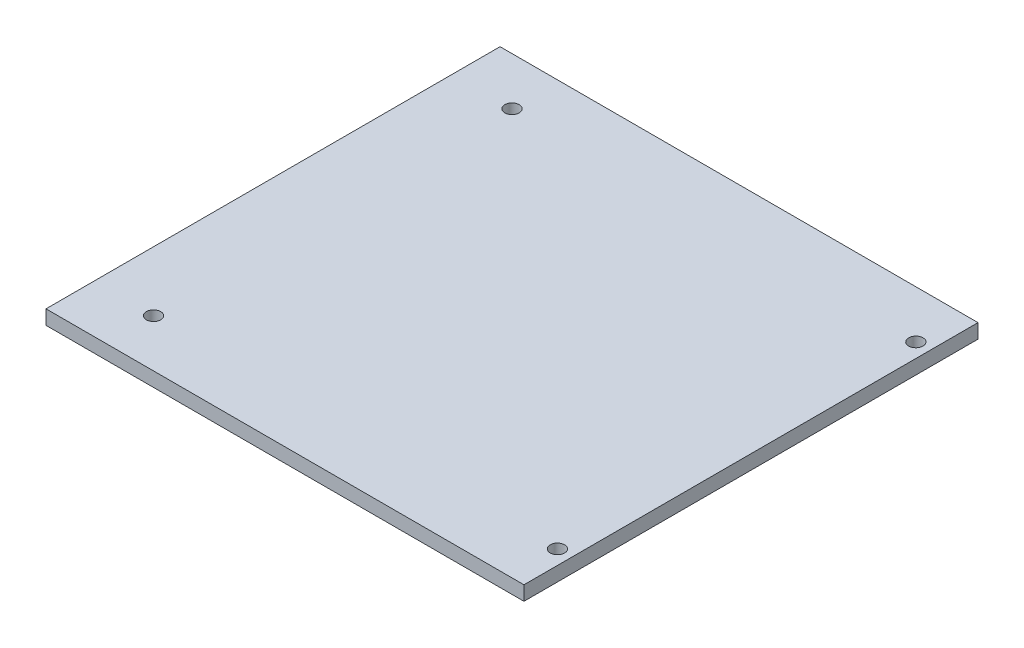
ISO-10303-21;
HEADER;
FILE_DESCRIPTION(('STEP AP214'),'2;1');
FILE_NAME('part.step','',(''),(''),'','','');
FILE_SCHEMA(('AUTOMOTIVE_DESIGN { 1 0 10303 214 1 1 1 1 }'));
ENDSEC;
DATA;
#1=APPLICATION_CONTEXT('core data for automotive mechanical design processes');
#2=APPLICATION_PROTOCOL_DEFINITION('international standard','automotive_design',2000,#1);
#3=PRODUCT_CONTEXT('',#1,'mechanical');
#4=PRODUCT('Part','Part','',(#3));
#5=PRODUCT_RELATED_PRODUCT_CATEGORY('part','',(#4));
#6=PRODUCT_DEFINITION_FORMATION('','',#4);
#7=PRODUCT_DEFINITION_CONTEXT('part definition',#1,'design');
#8=PRODUCT_DEFINITION('design','',#6,#7);
#9=PRODUCT_DEFINITION_SHAPE('','',#8);
#10=(LENGTH_UNIT() NAMED_UNIT(*) SI_UNIT(.MILLI.,.METRE.));
#11=(NAMED_UNIT(*) PLANE_ANGLE_UNIT() SI_UNIT($,.RADIAN.));
#12=(NAMED_UNIT(*) SI_UNIT($,.STERADIAN.) SOLID_ANGLE_UNIT());
#13=UNCERTAINTY_MEASURE_WITH_UNIT(LENGTH_MEASURE(1.E-05),#10,'distance_accuracy_value','');
#14=(GEOMETRIC_REPRESENTATION_CONTEXT(3) GLOBAL_UNCERTAINTY_ASSIGNED_CONTEXT((#13)) GLOBAL_UNIT_ASSIGNED_CONTEXT((#10,
#11,#12)) REPRESENTATION_CONTEXT('',''));
#15=CARTESIAN_POINT('',(0.,0.,0.));
#16=DIRECTION('',(0.,0.,1.));
#17=DIRECTION('',(1.,0.,0.));
#18=AXIS2_PLACEMENT_3D('',#15,#16,#17);
#19=CARTESIAN_POINT('',(0.,3.,0.));
#20=DIRECTION('',(0.,1.,0.));
#21=DIRECTION('',(0.,0.,1.));
#22=AXIS2_PLACEMENT_3D('',#19,#20,#21);
#23=PLANE('',#22);
#24=CARTESIAN_POINT('',(47.,3.,37.5));
#25=DIRECTION('',(0.,1.,0.));
#26=DIRECTION('',(0.,0.,1.));
#27=AXIS2_PLACEMENT_3D('',#24,#25,#26);
#28=CIRCLE('',#27,1.5);
#29=CARTESIAN_POINT('',(47.,3.,39.));
#30=VERTEX_POINT('',#29);
#31=EDGE_CURVE('E121',#30,#30,#28,.T.);
#32=ORIENTED_EDGE('',*,*,#31,.F.);
#33=EDGE_LOOP('',(#32));
#34=FACE_BOUND('',#33,.T.);
#35=CARTESIAN_POINT('',(-37.5,3.,-37.5));
#36=DIRECTION('',(0.,1.,0.));
#37=DIRECTION('',(0.,0.,1.));
#38=AXIS2_PLACEMENT_3D('',#35,#36,#37);
#39=CIRCLE('',#38,1.5);
#40=CARTESIAN_POINT('',(-37.5,3.,-36.));
#41=VERTEX_POINT('',#40);
#42=EDGE_CURVE('E100',#41,#41,#39,.T.);
#43=ORIENTED_EDGE('',*,*,#42,.F.);
#44=EDGE_LOOP('',(#43));
#45=FACE_BOUND('',#44,.T.);
#46=DIRECTION('',(0.,0.,1.));
#47=VECTOR('',#46,1.);
#48=CARTESIAN_POINT('',(-50.,3.,47.5));
#49=LINE('',#48,#47);
#50=CARTESIAN_POINT('',(-50.,3.,-47.5));
#51=VERTEX_POINT('',#50);
#52=CARTESIAN_POINT('',(-50.,3.,47.5));
#53=VERTEX_POINT('',#52);
#54=EDGE_CURVE('E85',#51,#53,#49,.T.);
#55=ORIENTED_EDGE('',*,*,#54,.T.);
#56=DIRECTION('',(1.,0.,0.));
#57=VECTOR('',#56,1.);
#58=CARTESIAN_POINT('',(50.,3.,47.5));
#59=LINE('',#58,#57);
#60=CARTESIAN_POINT('',(50.,3.,47.5));
#61=VERTEX_POINT('',#60);
#62=EDGE_CURVE('E80',#53,#61,#59,.T.);
#63=ORIENTED_EDGE('',*,*,#62,.T.);
#64=DIRECTION('',(0.,0.,-1.));
#65=VECTOR('',#64,1.);
#66=CARTESIAN_POINT('',(50.,3.,47.5));
#67=LINE('',#66,#65);
#68=CARTESIAN_POINT('',(50.,3.,-47.5));
#69=VERTEX_POINT('',#68);
#70=EDGE_CURVE('E83',#61,#69,#67,.T.);
#71=ORIENTED_EDGE('',*,*,#70,.T.);
#72=DIRECTION('',(-1.,0.,0.));
#73=VECTOR('',#72,1.);
#74=CARTESIAN_POINT('',(50.,3.,-47.5));
#75=LINE('',#74,#73);
#76=EDGE_CURVE('E50',#69,#51,#75,.T.);
#77=ORIENTED_EDGE('',*,*,#76,.T.);
#78=EDGE_LOOP('',(#55,#63,#71,#77));
#79=FACE_BOUND('',#78,.T.);
#80=CARTESIAN_POINT('',(47.,3.,-37.5));
#81=DIRECTION('',(0.,1.,0.));
#82=DIRECTION('',(0.,0.,1.));
#83=AXIS2_PLACEMENT_3D('',#80,#81,#82);
#84=CIRCLE('',#83,1.5);
#85=CARTESIAN_POINT('',(47.,3.,-36.));
#86=VERTEX_POINT('',#85);
#87=EDGE_CURVE('E115',#86,#86,#84,.T.);
#88=ORIENTED_EDGE('',*,*,#87,.F.);
#89=EDGE_LOOP('',(#88));
#90=FACE_BOUND('',#89,.T.);
#91=CARTESIAN_POINT('',(-37.5,3.,37.5));
#92=DIRECTION('',(0.,1.,0.));
#93=DIRECTION('',(0.,0.,1.));
#94=AXIS2_PLACEMENT_3D('',#91,#92,#93);
#95=CIRCLE('',#94,1.5);
#96=CARTESIAN_POINT('',(-37.5,3.,39.));
#97=VERTEX_POINT('',#96);
#98=EDGE_CURVE('E127',#97,#97,#95,.T.);
#99=ORIENTED_EDGE('',*,*,#98,.F.);
#100=EDGE_LOOP('',(#99));
#101=FACE_BOUND('',#100,.T.);
#102=ADVANCED_FACE('F33',(#34,#45,#79,#90,#101),#23,.T.);
#103=CARTESIAN_POINT('',(0.,0.,0.));
#104=DIRECTION('',(0.,1.,0.));
#105=DIRECTION('',(0.,0.,1.));
#106=AXIS2_PLACEMENT_3D('',#103,#104,#105);
#107=PLANE('',#106);
#108=CARTESIAN_POINT('',(47.,0.,37.5));
#109=DIRECTION('',(0.,1.,0.));
#110=DIRECTION('',(0.,0.,1.));
#111=AXIS2_PLACEMENT_3D('',#108,#109,#110);
#112=CIRCLE('',#111,1.5);
#113=CARTESIAN_POINT('',(47.,0.,39.));
#114=VERTEX_POINT('',#113);
#115=EDGE_CURVE('E124',#114,#114,#112,.T.);
#116=ORIENTED_EDGE('',*,*,#115,.T.);
#117=EDGE_LOOP('',(#116));
#118=FACE_BOUND('',#117,.T.);
#119=CARTESIAN_POINT('',(-37.5,0.,-37.5));
#120=DIRECTION('',(0.,1.,0.));
#121=DIRECTION('',(0.,0.,1.));
#122=AXIS2_PLACEMENT_3D('',#119,#120,#121);
#123=CIRCLE('',#122,1.5);
#124=CARTESIAN_POINT('',(-37.5,0.,-36.));
#125=VERTEX_POINT('',#124);
#126=EDGE_CURVE('E112',#125,#125,#123,.T.);
#127=ORIENTED_EDGE('',*,*,#126,.T.);
#128=EDGE_LOOP('',(#127));
#129=FACE_BOUND('',#128,.T.);
#130=DIRECTION('',(0.,0.,1.));
#131=VECTOR('',#130,1.);
#132=CARTESIAN_POINT('',(-50.,0.,47.5));
#133=LINE('',#132,#131);
#134=CARTESIAN_POINT('',(-50.,0.,-47.5));
#135=VERTEX_POINT('',#134);
#136=CARTESIAN_POINT('',(-50.,0.,47.5));
#137=VERTEX_POINT('',#136);
#138=EDGE_CURVE('E97',#135,#137,#133,.T.);
#139=ORIENTED_EDGE('',*,*,#138,.F.);
#140=DIRECTION('',(-1.,0.,0.));
#141=VECTOR('',#140,1.);
#142=CARTESIAN_POINT('',(50.,0.,-47.5));
#143=LINE('',#142,#141);
#144=CARTESIAN_POINT('',(50.,0.,-47.5));
#145=VERTEX_POINT('',#144);
#146=EDGE_CURVE('E73',#145,#135,#143,.T.);
#147=ORIENTED_EDGE('',*,*,#146,.F.);
#148=DIRECTION('',(0.,0.,-1.));
#149=VECTOR('',#148,1.);
#150=CARTESIAN_POINT('',(50.,0.,47.5));
#151=LINE('',#150,#149);
#152=CARTESIAN_POINT('',(50.,0.,47.5));
#153=VERTEX_POINT('',#152);
#154=EDGE_CURVE('E67',#153,#145,#151,.T.);
#155=ORIENTED_EDGE('',*,*,#154,.F.);
#156=DIRECTION('',(1.,0.,0.));
#157=VECTOR('',#156,1.);
#158=CARTESIAN_POINT('',(50.,0.,47.5));
#159=LINE('',#158,#157);
#160=EDGE_CURVE('E89',#137,#153,#159,.T.);
#161=ORIENTED_EDGE('',*,*,#160,.F.);
#162=EDGE_LOOP('',(#139,#147,#155,#161));
#163=FACE_BOUND('',#162,.T.);
#164=CARTESIAN_POINT('',(47.,0.,-37.5));
#165=DIRECTION('',(0.,1.,0.));
#166=DIRECTION('',(0.,0.,1.));
#167=AXIS2_PLACEMENT_3D('',#164,#165,#166);
#168=CIRCLE('',#167,1.5);
#169=CARTESIAN_POINT('',(47.,0.,-36.));
#170=VERTEX_POINT('',#169);
#171=EDGE_CURVE('E118',#170,#170,#168,.T.);
#172=ORIENTED_EDGE('',*,*,#171,.T.);
#173=EDGE_LOOP('',(#172));
#174=FACE_BOUND('',#173,.T.);
#175=CARTESIAN_POINT('',(-37.5,0.,37.5));
#176=DIRECTION('',(0.,1.,0.));
#177=DIRECTION('',(0.,0.,1.));
#178=AXIS2_PLACEMENT_3D('',#175,#176,#177);
#179=CIRCLE('',#178,1.5);
#180=CARTESIAN_POINT('',(-37.5,0.,39.));
#181=VERTEX_POINT('',#180);
#182=EDGE_CURVE('E130',#181,#181,#179,.T.);
#183=ORIENTED_EDGE('',*,*,#182,.T.);
#184=EDGE_LOOP('',(#183));
#185=FACE_BOUND('',#184,.T.);
#186=ADVANCED_FACE('F108',(#118,#129,#163,#174,#185),#107,.F.);
#187=CARTESIAN_POINT('',(-50.,3.,47.5));
#188=DIRECTION('',(1.,0.,0.));
#189=DIRECTION('',(0.,0.,-1.));
#190=AXIS2_PLACEMENT_3D('',#187,#188,#189);
#191=PLANE('',#190);
#192=ORIENTED_EDGE('',*,*,#138,.T.);
#193=DIRECTION('',(0.,-1.,0.));
#194=VECTOR('',#193,1.);
#195=CARTESIAN_POINT('',(-50.,3.,47.5));
#196=LINE('',#195,#194);
#197=EDGE_CURVE('E11',#53,#137,#196,.T.);
#198=ORIENTED_EDGE('',*,*,#197,.F.);
#199=ORIENTED_EDGE('',*,*,#54,.F.);
#200=DIRECTION('',(0.,-1.,0.));
#201=VECTOR('',#200,1.);
#202=CARTESIAN_POINT('',(-50.,3.,-47.5));
#203=LINE('',#202,#201);
#204=EDGE_CURVE('E93',#51,#135,#203,.T.);
#205=ORIENTED_EDGE('',*,*,#204,.T.);
#206=EDGE_LOOP('',(#192,#198,#199,#205));
#207=FACE_BOUND('',#206,.T.);
#208=ADVANCED_FACE('F35',(#207),#191,.F.);
#209=CARTESIAN_POINT('',(50.,3.,47.5));
#210=DIRECTION('',(0.,0.,-1.));
#211=DIRECTION('',(-1.,0.,0.));
#212=AXIS2_PLACEMENT_3D('',#209,#210,#211);
#213=PLANE('',#212);
#214=ORIENTED_EDGE('',*,*,#160,.T.);
#215=DIRECTION('',(0.,-1.,0.));
#216=VECTOR('',#215,1.);
#217=CARTESIAN_POINT('',(50.,3.,47.5));
#218=LINE('',#217,#216);
#219=EDGE_CURVE('E42',#61,#153,#218,.T.);
#220=ORIENTED_EDGE('',*,*,#219,.F.);
#221=ORIENTED_EDGE('',*,*,#62,.F.);
#222=ORIENTED_EDGE('',*,*,#197,.T.);
#223=EDGE_LOOP('',(#214,#220,#221,#222));
#224=FACE_BOUND('',#223,.T.);
#225=ADVANCED_FACE('F88',(#224),#213,.F.);
#226=CARTESIAN_POINT('',(50.,3.,47.5));
#227=DIRECTION('',(-1.,0.,0.));
#228=DIRECTION('',(0.,0.,1.));
#229=AXIS2_PLACEMENT_3D('',#226,#227,#228);
#230=PLANE('',#229);
#231=ORIENTED_EDGE('',*,*,#154,.T.);
#232=DIRECTION('',(0.,-1.,0.));
#233=VECTOR('',#232,1.);
#234=CARTESIAN_POINT('',(50.,3.,-47.5));
#235=LINE('',#234,#233);
#236=EDGE_CURVE('E90',#69,#145,#235,.T.);
#237=ORIENTED_EDGE('',*,*,#236,.F.);
#238=ORIENTED_EDGE('',*,*,#70,.F.);
#239=ORIENTED_EDGE('',*,*,#219,.T.);
#240=EDGE_LOOP('',(#231,#237,#238,#239));
#241=FACE_BOUND('',#240,.T.);
#242=ADVANCED_FACE('F91',(#241),#230,.F.);
#243=CARTESIAN_POINT('',(50.,3.,-47.5));
#244=DIRECTION('',(0.,0.,1.));
#245=DIRECTION('',(1.,0.,0.));
#246=AXIS2_PLACEMENT_3D('',#243,#244,#245);
#247=PLANE('',#246);
#248=ORIENTED_EDGE('',*,*,#146,.T.);
#249=ORIENTED_EDGE('',*,*,#204,.F.);
#250=ORIENTED_EDGE('',*,*,#76,.F.);
#251=ORIENTED_EDGE('',*,*,#236,.T.);
#252=EDGE_LOOP('',(#248,#249,#250,#251));
#253=FACE_BOUND('',#252,.T.);
#254=ADVANCED_FACE('F105',(#253),#247,.F.);
#255=CARTESIAN_POINT('',(-37.5,3.,-37.5));
#256=DIRECTION('',(0.,-1.,0.));
#257=DIRECTION('',(0.,0.,-1.));
#258=AXIS2_PLACEMENT_3D('',#255,#256,#257);
#259=CYLINDRICAL_SURFACE('',#258,1.5);
#260=ORIENTED_EDGE('',*,*,#42,.T.);
#261=EDGE_LOOP('',(#260));
#262=FACE_BOUND('',#261,.T.);
#263=ORIENTED_EDGE('',*,*,#126,.F.);
#264=EDGE_LOOP('',(#263));
#265=FACE_BOUND('',#264,.T.);
#266=ADVANCED_FACE('F150',(#262,#265),#259,.F.);
#267=CARTESIAN_POINT('',(47.,3.,-37.5));
#268=DIRECTION('',(0.,-1.,0.));
#269=DIRECTION('',(0.,0.,-1.));
#270=AXIS2_PLACEMENT_3D('',#267,#268,#269);
#271=CYLINDRICAL_SURFACE('',#270,1.5);
#272=ORIENTED_EDGE('',*,*,#87,.T.);
#273=EDGE_LOOP('',(#272));
#274=FACE_BOUND('',#273,.T.);
#275=ORIENTED_EDGE('',*,*,#171,.F.);
#276=EDGE_LOOP('',(#275));
#277=FACE_BOUND('',#276,.T.);
#278=ADVANCED_FACE('F196',(#274,#277),#271,.F.);
#279=CARTESIAN_POINT('',(47.,3.,37.5));
#280=DIRECTION('',(0.,-1.,0.));
#281=DIRECTION('',(0.,0.,-1.));
#282=AXIS2_PLACEMENT_3D('',#279,#280,#281);
#283=CYLINDRICAL_SURFACE('',#282,1.5);
#284=ORIENTED_EDGE('',*,*,#31,.T.);
#285=EDGE_LOOP('',(#284));
#286=FACE_BOUND('',#285,.T.);
#287=ORIENTED_EDGE('',*,*,#115,.F.);
#288=EDGE_LOOP('',(#287));
#289=FACE_BOUND('',#288,.T.);
#290=ADVANCED_FACE('F204',(#286,#289),#283,.F.);
#291=CARTESIAN_POINT('',(-37.5,3.,37.5));
#292=DIRECTION('',(0.,-1.,0.));
#293=DIRECTION('',(0.,0.,-1.));
#294=AXIS2_PLACEMENT_3D('',#291,#292,#293);
#295=CYLINDRICAL_SURFACE('',#294,1.5);
#296=ORIENTED_EDGE('',*,*,#98,.T.);
#297=EDGE_LOOP('',(#296));
#298=FACE_BOUND('',#297,.T.);
#299=ORIENTED_EDGE('',*,*,#182,.F.);
#300=EDGE_LOOP('',(#299));
#301=FACE_BOUND('',#300,.T.);
#302=ADVANCED_FACE('F136',(#298,#301),#295,.F.);
#303=CLOSED_SHELL('',(#102,#186,#208,#225,#242,#254,#266,#278,#290,#302));
#304=MANIFOLD_SOLID_BREP('B2',#303);
#305=ADVANCED_BREP_SHAPE_REPRESENTATION('',(#18,#304),#14);
#306=SHAPE_DEFINITION_REPRESENTATION(#9,#305);
ENDSEC;
END-ISO-10303-21;
